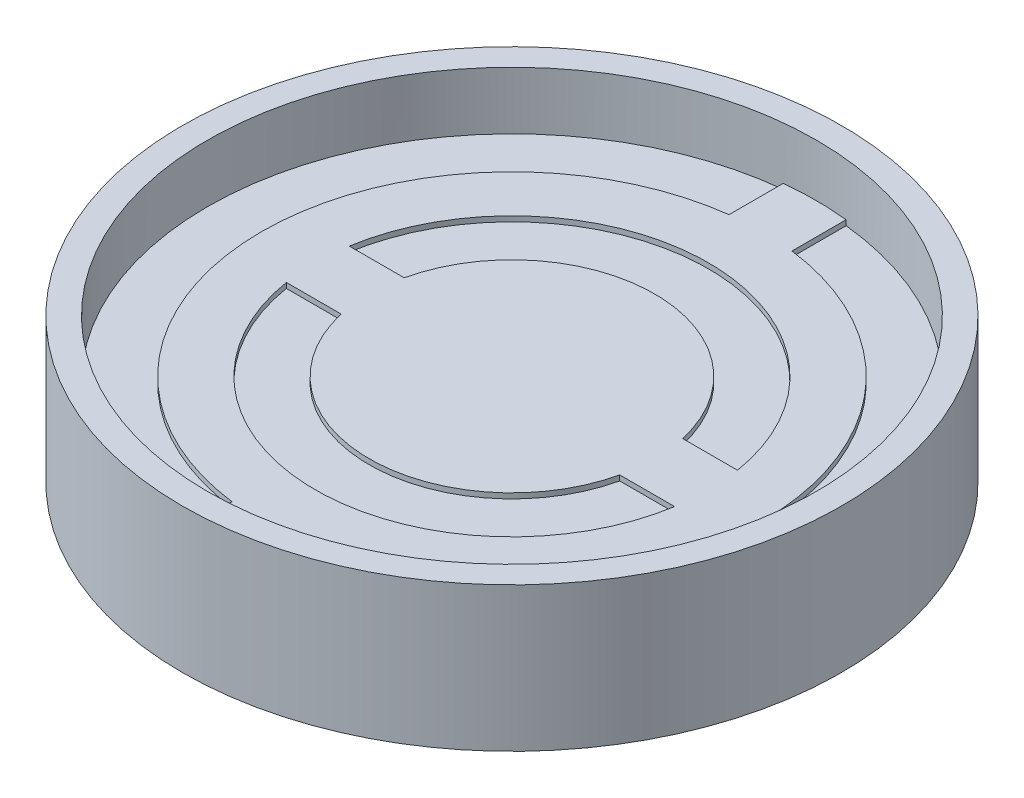
ISO-10303-21;
HEADER;
FILE_DESCRIPTION(('STEP AP214'),'2;1');
FILE_NAME('part.step','',(''),(''),'','','');
FILE_SCHEMA(('AUTOMOTIVE_DESIGN { 1 0 10303 214 1 1 1 1 }'));
ENDSEC;
DATA;
#1=APPLICATION_CONTEXT('core data for automotive mechanical design processes');
#2=APPLICATION_PROTOCOL_DEFINITION('international standard','automotive_design',2000,#1);
#3=PRODUCT_CONTEXT('',#1,'mechanical');
#4=PRODUCT('Part','Part','',(#3));
#5=PRODUCT_RELATED_PRODUCT_CATEGORY('part','',(#4));
#6=PRODUCT_DEFINITION_FORMATION('','',#4);
#7=PRODUCT_DEFINITION_CONTEXT('part definition',#1,'design');
#8=PRODUCT_DEFINITION('design','',#6,#7);
#9=PRODUCT_DEFINITION_SHAPE('','',#8);
#10=(LENGTH_UNIT() NAMED_UNIT(*) SI_UNIT(.MILLI.,.METRE.));
#11=(NAMED_UNIT(*) PLANE_ANGLE_UNIT() SI_UNIT($,.RADIAN.));
#12=(NAMED_UNIT(*) SI_UNIT($,.STERADIAN.) SOLID_ANGLE_UNIT());
#13=UNCERTAINTY_MEASURE_WITH_UNIT(LENGTH_MEASURE(1.E-05),#10,'distance_accuracy_value','');
#14=(GEOMETRIC_REPRESENTATION_CONTEXT(3) GLOBAL_UNCERTAINTY_ASSIGNED_CONTEXT((#13)) GLOBAL_UNIT_ASSIGNED_CONTEXT((#10,
#11,#12)) REPRESENTATION_CONTEXT('',''));
#15=CARTESIAN_POINT('',(0.,0.,0.));
#16=DIRECTION('',(0.,0.,1.));
#17=DIRECTION('',(1.,0.,0.));
#18=AXIS2_PLACEMENT_3D('',#15,#16,#17);
#19=CARTESIAN_POINT('',(0.,-0.6985,0.));
#20=DIRECTION('',(0.,-1.,0.));
#21=DIRECTION('',(0.,0.,1.));
#22=AXIS2_PLACEMENT_3D('',#19,#20,#21);
#23=PLANE('',#22);
#24=CARTESIAN_POINT('',(0.,-0.6985,0.));
#25=DIRECTION('',(0.,1.,0.));
#26=DIRECTION('',(0.,0.,1.));
#27=AXIS2_PLACEMENT_3D('',#24,#25,#26);
#28=CIRCLE('',#27,12.13485);
#29=CARTESIAN_POINT('',(1.524,-0.6985,12.0387710553237));
#30=VERTEX_POINT('',#29);
#31=CARTESIAN_POINT('',(1.524,-0.6985,-12.0387710553237));
#32=VERTEX_POINT('',#31);
#33=EDGE_CURVE('E357',#30,#32,#28,.T.);
#34=ORIENTED_EDGE('',*,*,#33,.T.);
#35=DIRECTION('',(0.,0.,1.));
#36=VECTOR('',#35,1.);
#37=CARTESIAN_POINT('',(1.524,-0.6985,0.));
#38=LINE('',#37,#36);
#39=CARTESIAN_POINT('',(1.524,-0.6985,-14.6657288291445));
#40=VERTEX_POINT('',#39);
#41=EDGE_CURVE('E353',#40,#32,#38,.T.);
#42=ORIENTED_EDGE('',*,*,#41,.F.);
#43=CARTESIAN_POINT('',(0.,-0.6985,0.));
#44=DIRECTION('',(0.,1.,0.));
#45=DIRECTION('',(0.,0.,1.));
#46=AXIS2_PLACEMENT_3D('',#43,#44,#45);
#47=CIRCLE('',#46,14.7447);
#48=CARTESIAN_POINT('',(1.524,-0.6985,14.6657288291445));
#49=VERTEX_POINT('',#48);
#50=EDGE_CURVE('E419',#49,#40,#47,.T.);
#51=ORIENTED_EDGE('',*,*,#50,.F.);
#52=DIRECTION('',(0.,0.,-1.));
#53=VECTOR('',#52,1.);
#54=CARTESIAN_POINT('',(1.524,-0.6985,0.));
#55=LINE('',#54,#53);
#56=EDGE_CURVE('E360',#49,#30,#55,.T.);
#57=ORIENTED_EDGE('',*,*,#56,.T.);
#58=EDGE_LOOP('',(#34,#42,#51,#57));
#59=FACE_BOUND('',#58,.T.);
#60=ADVANCED_FACE('F44',(#59),#23,.T.);
#61=CARTESIAN_POINT('',(0.,0.6985,0.));
#62=DIRECTION('',(0.,1.,0.));
#63=DIRECTION('',(0.,0.,1.));
#64=AXIS2_PLACEMENT_3D('',#61,#62,#63);
#65=CYLINDRICAL_SURFACE('',#64,14.7447);
#66=CARTESIAN_POINT('',(0.,3.4925,0.));
#67=DIRECTION('',(0.,1.,0.));
#68=DIRECTION('',(0.,0.,1.));
#69=AXIS2_PLACEMENT_3D('',#66,#67,#68);
#70=CIRCLE('',#69,14.7447);
#71=CARTESIAN_POINT('',(0.,3.4925,14.7447));
#72=VERTEX_POINT('',#71);
#73=EDGE_CURVE('E559',#72,#72,#70,.T.);
#74=ORIENTED_EDGE('',*,*,#73,.T.);
#75=EDGE_LOOP('',(#74));
#76=FACE_BOUND('',#75,.T.);
#77=DIRECTION('',(0.,-1.,0.));
#78=VECTOR('',#77,1.);
#79=CARTESIAN_POINT('',(-1.524,0.9525,-14.6657288291445));
#80=LINE('',#79,#78);
#81=CARTESIAN_POINT('',(-1.524,0.9525,-14.6657288291445));
#82=VERTEX_POINT('',#81);
#83=CARTESIAN_POINT('',(-1.524,0.6985,-14.6657288291445));
#84=VERTEX_POINT('',#83);
#85=EDGE_CURVE('E527',#82,#84,#80,.T.);
#86=ORIENTED_EDGE('',*,*,#85,.F.);
#87=CARTESIAN_POINT('',(0.,0.9525,0.));
#88=DIRECTION('',(0.,1.,0.));
#89=DIRECTION('',(0.,0.,1.));
#90=AXIS2_PLACEMENT_3D('',#87,#88,#89);
#91=CIRCLE('',#90,14.7447);
#92=CARTESIAN_POINT('',(1.524,0.9525,-14.6657288291445));
#93=VERTEX_POINT('',#92);
#94=EDGE_CURVE('E479',#93,#82,#91,.T.);
#95=ORIENTED_EDGE('',*,*,#94,.F.);
#96=DIRECTION('',(0.,-1.,0.));
#97=VECTOR('',#96,1.);
#98=CARTESIAN_POINT('',(1.524,0.9525,-14.6657288291445));
#99=LINE('',#98,#97);
#100=CARTESIAN_POINT('',(1.524,0.6985,-14.6657288291445));
#101=VERTEX_POINT('',#100);
#102=EDGE_CURVE('E531',#93,#101,#99,.T.);
#103=ORIENTED_EDGE('',*,*,#102,.T.);
#104=CARTESIAN_POINT('',(0.,0.6985,0.));
#105=DIRECTION('',(0.,1.,0.));
#106=DIRECTION('',(0.,0.,1.));
#107=AXIS2_PLACEMENT_3D('',#104,#105,#106);
#108=CIRCLE('',#107,14.7447);
#109=CARTESIAN_POINT('',(1.524,0.6985,14.6657288291445));
#110=VERTEX_POINT('',#109);
#111=EDGE_CURVE('E588',#110,#101,#108,.T.);
#112=ORIENTED_EDGE('',*,*,#111,.F.);
#113=DIRECTION('',(0.,-1.,0.));
#114=VECTOR('',#113,1.);
#115=CARTESIAN_POINT('',(1.524,0.9525,14.6657288291445));
#116=LINE('',#115,#114);
#117=CARTESIAN_POINT('',(1.524,0.9525,14.6657288291445));
#118=VERTEX_POINT('',#117);
#119=EDGE_CURVE('E544',#118,#110,#116,.T.);
#120=ORIENTED_EDGE('',*,*,#119,.F.);
#121=CARTESIAN_POINT('',(0.,0.9525,0.));
#122=DIRECTION('',(0.,1.,0.));
#123=DIRECTION('',(0.,0.,1.));
#124=AXIS2_PLACEMENT_3D('',#121,#122,#123);
#125=CIRCLE('',#124,14.7447);
#126=CARTESIAN_POINT('',(-1.524,0.9525,14.6657288291445));
#127=VERTEX_POINT('',#126);
#128=EDGE_CURVE('E468',#127,#118,#125,.T.);
#129=ORIENTED_EDGE('',*,*,#128,.F.);
#130=DIRECTION('',(0.,-1.,0.));
#131=VECTOR('',#130,1.);
#132=CARTESIAN_POINT('',(-1.524,0.9525,14.6657288291445));
#133=LINE('',#132,#131);
#134=CARTESIAN_POINT('',(-1.524,0.6985,14.6657288291445));
#135=VERTEX_POINT('',#134);
#136=EDGE_CURVE('E548',#127,#135,#133,.T.);
#137=ORIENTED_EDGE('',*,*,#136,.T.);
#138=EDGE_CURVE('E591',#84,#135,#108,.T.);
#139=ORIENTED_EDGE('',*,*,#138,.F.);
#140=EDGE_LOOP('',(#86,#95,#103,#112,#120,#129,#137,#139));
#141=FACE_BOUND('',#140,.T.);
#142=ADVANCED_FACE('F614',(#76,#141),#65,.F.);
#143=CARTESIAN_POINT('',(0.,0.6985,0.));
#144=DIRECTION('',(0.,1.,0.));
#145=DIRECTION('',(0.,0.,1.));
#146=AXIS2_PLACEMENT_3D('',#143,#144,#145);
#147=PLANE('',#146);
#148=CARTESIAN_POINT('',(0.,0.6985,0.));
#149=DIRECTION('',(0.,1.,0.));
#150=DIRECTION('',(0.,0.,1.));
#151=AXIS2_PLACEMENT_3D('',#148,#149,#150);
#152=CIRCLE('',#151,12.13485);
#153=CARTESIAN_POINT('',(-1.524,0.6985,-12.0387710553237));
#154=VERTEX_POINT('',#153);
#155=CARTESIAN_POINT('',(-1.524,0.6985,12.0387710553237));
#156=VERTEX_POINT('',#155);
#157=EDGE_CURVE('E513',#154,#156,#152,.T.);
#158=ORIENTED_EDGE('',*,*,#157,.F.);
#159=DIRECTION('',(0.,0.,1.));
#160=VECTOR('',#159,1.);
#161=CARTESIAN_POINT('',(-1.524,0.6985,0.));
#162=LINE('',#161,#160);
#163=EDGE_CURVE('E509',#84,#154,#162,.T.);
#164=ORIENTED_EDGE('',*,*,#163,.F.);
#165=ORIENTED_EDGE('',*,*,#138,.T.);
#166=DIRECTION('',(0.,0.,-1.));
#167=VECTOR('',#166,1.);
#168=CARTESIAN_POINT('',(-1.524,0.6985,0.));
#169=LINE('',#168,#167);
#170=EDGE_CURVE('E517',#135,#156,#169,.T.);
#171=ORIENTED_EDGE('',*,*,#170,.T.);
#172=EDGE_LOOP('',(#158,#164,#165,#171));
#173=FACE_BOUND('',#172,.T.);
#174=ADVANCED_FACE('F601',(#173),#147,.T.);
#175=CARTESIAN_POINT('',(1.524,0.6985,12.0387710553237));
#176=VERTEX_POINT('',#175);
#177=CARTESIAN_POINT('',(1.524,0.6985,-12.0387710553237));
#178=VERTEX_POINT('',#177);
#179=EDGE_CURVE('E518',#176,#178,#152,.T.);
#180=ORIENTED_EDGE('',*,*,#179,.F.);
#181=DIRECTION('',(0.,0.,-1.));
#182=VECTOR('',#181,1.);
#183=CARTESIAN_POINT('',(1.524,0.6985,0.));
#184=LINE('',#183,#182);
#185=EDGE_CURVE('E521',#110,#176,#184,.T.);
#186=ORIENTED_EDGE('',*,*,#185,.F.);
#187=ORIENTED_EDGE('',*,*,#111,.T.);
#188=DIRECTION('',(0.,0.,1.));
#189=VECTOR('',#188,1.);
#190=CARTESIAN_POINT('',(1.524,0.6985,0.));
#191=LINE('',#190,#189);
#192=EDGE_CURVE('E432',#101,#178,#191,.T.);
#193=ORIENTED_EDGE('',*,*,#192,.T.);
#194=EDGE_LOOP('',(#180,#186,#187,#193));
#195=FACE_BOUND('',#194,.T.);
#196=ADVANCED_FACE('F819',(#195),#147,.T.);
#197=CARTESIAN_POINT('',(0.,3.4925,0.));
#198=DIRECTION('',(0.,-1.,0.));
#199=DIRECTION('',(0.,0.,-1.));
#200=AXIS2_PLACEMENT_3D('',#197,#198,#199);
#201=CYLINDRICAL_SURFACE('',#200,15.9639);
#202=CARTESIAN_POINT('',(0.,3.4925,0.));
#203=DIRECTION('',(0.,1.,0.));
#204=DIRECTION('',(0.,0.,1.));
#205=AXIS2_PLACEMENT_3D('',#202,#203,#204);
#206=CIRCLE('',#205,15.9639);
#207=CARTESIAN_POINT('',(0.,3.4925,15.9639));
#208=VERTEX_POINT('',#207);
#209=EDGE_CURVE('E11',#208,#208,#206,.T.);
#210=ORIENTED_EDGE('',*,*,#209,.F.);
#211=EDGE_LOOP('',(#210));
#212=FACE_BOUND('',#211,.T.);
#213=CARTESIAN_POINT('',(0.,-3.4925,0.));
#214=DIRECTION('',(0.,1.,0.));
#215=DIRECTION('',(0.,0.,1.));
#216=AXIS2_PLACEMENT_3D('',#213,#214,#215);
#217=CIRCLE('',#216,15.9639);
#218=CARTESIAN_POINT('',(0.,-3.4925,15.9639));
#219=VERTEX_POINT('',#218);
#220=EDGE_CURVE('E48',#219,#219,#217,.T.);
#221=ORIENTED_EDGE('',*,*,#220,.T.);
#222=EDGE_LOOP('',(#221));
#223=FACE_BOUND('',#222,.T.);
#224=ADVANCED_FACE('F46',(#212,#223),#201,.T.);
#225=CARTESIAN_POINT('',(0.,3.4925,0.));
#226=DIRECTION('',(0.,1.,0.));
#227=DIRECTION('',(0.,0.,1.));
#228=AXIS2_PLACEMENT_3D('',#225,#226,#227);
#229=PLANE('',#228);
#230=ORIENTED_EDGE('',*,*,#73,.F.);
#231=EDGE_LOOP('',(#230));
#232=FACE_BOUND('',#231,.T.);
#233=ORIENTED_EDGE('',*,*,#209,.T.);
#234=EDGE_LOOP('',(#233));
#235=FACE_BOUND('',#234,.T.);
#236=ADVANCED_FACE('F799',(#232,#235),#229,.T.);
#237=CARTESIAN_POINT('',(0.,-3.4925,0.));
#238=DIRECTION('',(0.,1.,0.));
#239=DIRECTION('',(0.,0.,1.));
#240=AXIS2_PLACEMENT_3D('',#237,#238,#239);
#241=PLANE('',#240);
#242=CARTESIAN_POINT('',(0.,-3.4925,0.));
#243=DIRECTION('',(0.,1.,0.));
#244=DIRECTION('',(0.,0.,1.));
#245=AXIS2_PLACEMENT_3D('',#242,#243,#244);
#246=CIRCLE('',#245,14.7447);
#247=CARTESIAN_POINT('',(0.,-3.4925,14.7447));
#248=VERTEX_POINT('',#247);
#249=EDGE_CURVE('E396',#248,#248,#246,.T.);
#250=ORIENTED_EDGE('',*,*,#249,.T.);
#251=EDGE_LOOP('',(#250));
#252=FACE_BOUND('',#251,.T.);
#253=ORIENTED_EDGE('',*,*,#220,.F.);
#254=EDGE_LOOP('',(#253));
#255=FACE_BOUND('',#254,.T.);
#256=ADVANCED_FACE('F795',(#252,#255),#241,.F.);
#257=CARTESIAN_POINT('',(-1.524,0.9525,0.));
#258=DIRECTION('',(1.,0.,0.));
#259=DIRECTION('',(0.,0.,-1.));
#260=AXIS2_PLACEMENT_3D('',#257,#258,#259);
#261=PLANE('',#260);
#262=ORIENTED_EDGE('',*,*,#163,.T.);
#263=DIRECTION('',(0.,-1.,0.));
#264=VECTOR('',#263,1.);
#265=CARTESIAN_POINT('',(-1.524,0.9525,-12.0387710553237));
#266=LINE('',#265,#264);
#267=CARTESIAN_POINT('',(-1.524,0.9525,-12.0387710553237));
#268=VERTEX_POINT('',#267);
#269=EDGE_CURVE('E555',#268,#154,#266,.T.);
#270=ORIENTED_EDGE('',*,*,#269,.F.);
#271=DIRECTION('',(0.,0.,1.));
#272=VECTOR('',#271,1.);
#273=CARTESIAN_POINT('',(-1.524,0.9525,0.));
#274=LINE('',#273,#272);
#275=EDGE_CURVE('E456',#82,#268,#274,.T.);
#276=ORIENTED_EDGE('',*,*,#275,.F.);
#277=ORIENTED_EDGE('',*,*,#85,.T.);
#278=EDGE_LOOP('',(#262,#270,#276,#277));
#279=FACE_BOUND('',#278,.T.);
#280=ADVANCED_FACE('F613',(#279),#261,.F.);
#281=CARTESIAN_POINT('',(0.,0.9525,0.));
#282=DIRECTION('',(0.,-1.,0.));
#283=DIRECTION('',(0.,0.,-1.));
#284=AXIS2_PLACEMENT_3D('',#281,#282,#283);
#285=CYLINDRICAL_SURFACE('',#284,12.13485);
#286=ORIENTED_EDGE('',*,*,#157,.T.);
#287=DIRECTION('',(0.,-1.,0.));
#288=VECTOR('',#287,1.);
#289=CARTESIAN_POINT('',(-1.524,0.9525,12.0387710553237));
#290=LINE('',#289,#288);
#291=CARTESIAN_POINT('',(-1.524,0.9525,12.0387710553237));
#292=VERTEX_POINT('',#291);
#293=EDGE_CURVE('E551',#292,#156,#290,.T.);
#294=ORIENTED_EDGE('',*,*,#293,.F.);
#295=CARTESIAN_POINT('',(0.,0.9525,0.));
#296=DIRECTION('',(0.,1.,0.));
#297=DIRECTION('',(0.,0.,1.));
#298=AXIS2_PLACEMENT_3D('',#295,#296,#297);
#299=CIRCLE('',#298,12.13485);
#300=EDGE_CURVE('E460',#268,#292,#299,.T.);
#301=ORIENTED_EDGE('',*,*,#300,.F.);
#302=ORIENTED_EDGE('',*,*,#269,.T.);
#303=EDGE_LOOP('',(#286,#294,#301,#302));
#304=FACE_BOUND('',#303,.T.);
#305=ADVANCED_FACE('F609',(#304),#285,.T.);
#306=CARTESIAN_POINT('',(-1.524,0.9525,0.));
#307=DIRECTION('',(-1.,0.,0.));
#308=DIRECTION('',(0.,0.,1.));
#309=AXIS2_PLACEMENT_3D('',#306,#307,#308);
#310=PLANE('',#309);
#311=ORIENTED_EDGE('',*,*,#170,.F.);
#312=ORIENTED_EDGE('',*,*,#136,.F.);
#313=DIRECTION('',(0.,0.,-1.));
#314=VECTOR('',#313,1.);
#315=CARTESIAN_POINT('',(-1.524,0.9525,0.));
#316=LINE('',#315,#314);
#317=EDGE_CURVE('E463',#127,#292,#316,.T.);
#318=ORIENTED_EDGE('',*,*,#317,.T.);
#319=ORIENTED_EDGE('',*,*,#293,.T.);
#320=EDGE_LOOP('',(#311,#312,#318,#319));
#321=FACE_BOUND('',#320,.T.);
#322=ADVANCED_FACE('F605',(#321),#310,.T.);
#323=CARTESIAN_POINT('',(1.524,0.9525,0.));
#324=DIRECTION('',(-1.,0.,0.));
#325=DIRECTION('',(0.,0.,1.));
#326=AXIS2_PLACEMENT_3D('',#323,#324,#325);
#327=PLANE('',#326);
#328=ORIENTED_EDGE('',*,*,#185,.T.);
#329=DIRECTION('',(0.,-1.,0.));
#330=VECTOR('',#329,1.);
#331=CARTESIAN_POINT('',(1.524,0.9525,12.0387710553237));
#332=LINE('',#331,#330);
#333=CARTESIAN_POINT('',(1.524,0.9525,12.0387710553237));
#334=VERTEX_POINT('',#333);
#335=EDGE_CURVE('E540',#334,#176,#332,.T.);
#336=ORIENTED_EDGE('',*,*,#335,.F.);
#337=DIRECTION('',(0.,0.,-1.));
#338=VECTOR('',#337,1.);
#339=CARTESIAN_POINT('',(1.524,0.9525,0.));
#340=LINE('',#339,#338);
#341=EDGE_CURVE('E472',#118,#334,#340,.T.);
#342=ORIENTED_EDGE('',*,*,#341,.F.);
#343=ORIENTED_EDGE('',*,*,#119,.T.);
#344=EDGE_LOOP('',(#328,#336,#342,#343));
#345=FACE_BOUND('',#344,.T.);
#346=ADVANCED_FACE('F629',(#345),#327,.F.);
#347=ORIENTED_EDGE('',*,*,#179,.T.);
#348=DIRECTION('',(0.,-1.,0.));
#349=VECTOR('',#348,1.);
#350=CARTESIAN_POINT('',(1.524,0.9525,-12.0387710553237));
#351=LINE('',#350,#349);
#352=CARTESIAN_POINT('',(1.524,0.9525,-12.0387710553237));
#353=VERTEX_POINT('',#352);
#354=EDGE_CURVE('E536',#353,#178,#351,.T.);
#355=ORIENTED_EDGE('',*,*,#354,.F.);
#356=EDGE_CURVE('E464',#334,#353,#299,.T.);
#357=ORIENTED_EDGE('',*,*,#356,.F.);
#358=ORIENTED_EDGE('',*,*,#335,.T.);
#359=EDGE_LOOP('',(#347,#355,#357,#358));
#360=FACE_BOUND('',#359,.T.);
#361=ADVANCED_FACE('F632',(#360),#285,.T.);
#362=CARTESIAN_POINT('',(1.524,0.9525,0.));
#363=DIRECTION('',(1.,0.,0.));
#364=DIRECTION('',(0.,0.,-1.));
#365=AXIS2_PLACEMENT_3D('',#362,#363,#364);
#366=PLANE('',#365);
#367=ORIENTED_EDGE('',*,*,#192,.F.);
#368=ORIENTED_EDGE('',*,*,#102,.F.);
#369=DIRECTION('',(0.,0.,1.));
#370=VECTOR('',#369,1.);
#371=CARTESIAN_POINT('',(1.524,0.9525,0.));
#372=LINE('',#371,#370);
#373=EDGE_CURVE('E475',#93,#353,#372,.T.);
#374=ORIENTED_EDGE('',*,*,#373,.T.);
#375=ORIENTED_EDGE('',*,*,#354,.T.);
#376=EDGE_LOOP('',(#367,#368,#374,#375));
#377=FACE_BOUND('',#376,.T.);
#378=ADVANCED_FACE('F623',(#377),#366,.T.);
#379=CARTESIAN_POINT('',(0.,0.9525,0.));
#380=DIRECTION('',(0.,-1.,0.));
#381=DIRECTION('',(0.,0.,-1.));
#382=AXIS2_PLACEMENT_3D('',#379,#380,#381);
#383=CYLINDRICAL_SURFACE('',#382,9.525);
#384=CARTESIAN_POINT('',(0.,0.6985,0.));
#385=DIRECTION('',(0.,1.,0.));
#386=DIRECTION('',(0.,0.,1.));
#387=AXIS2_PLACEMENT_3D('',#384,#385,#386);
#388=CIRCLE('',#387,9.525);
#389=CARTESIAN_POINT('',(9.40228956159084,0.6985,-1.524));
#390=VERTEX_POINT('',#389);
#391=CARTESIAN_POINT('',(-9.40228956159084,0.6985,-1.524));
#392=VERTEX_POINT('',#391);
#393=EDGE_CURVE('E499',#390,#392,#388,.T.);
#394=ORIENTED_EDGE('',*,*,#393,.F.);
#395=DIRECTION('',(0.,-1.,0.));
#396=VECTOR('',#395,1.);
#397=CARTESIAN_POINT('',(9.40228956159084,0.9525,-1.524));
#398=LINE('',#397,#396);
#399=CARTESIAN_POINT('',(9.40228956159084,0.9525,-1.524));
#400=VERTEX_POINT('',#399);
#401=EDGE_CURVE('E532',#400,#390,#398,.T.);
#402=ORIENTED_EDGE('',*,*,#401,.F.);
#403=CARTESIAN_POINT('',(0.,0.9525,0.));
#404=DIRECTION('',(0.,1.,0.));
#405=DIRECTION('',(0.,0.,1.));
#406=AXIS2_PLACEMENT_3D('',#403,#404,#405);
#407=CIRCLE('',#406,9.525);
#408=CARTESIAN_POINT('',(-9.40228956159084,0.9525,-1.524));
#409=VERTEX_POINT('',#408);
#410=EDGE_CURVE('E444',#400,#409,#407,.T.);
#411=ORIENTED_EDGE('',*,*,#410,.T.);
#412=DIRECTION('',(0.,-1.,0.));
#413=VECTOR('',#412,1.);
#414=CARTESIAN_POINT('',(-9.40228956159084,0.9525,-1.524));
#415=LINE('',#414,#413);
#416=EDGE_CURVE('E560',#409,#392,#415,.T.);
#417=ORIENTED_EDGE('',*,*,#416,.T.);
#418=EDGE_LOOP('',(#394,#402,#411,#417));
#419=FACE_BOUND('',#418,.T.);
#420=ADVANCED_FACE('F905',(#419),#383,.F.);
#421=CARTESIAN_POINT('',(0.,0.9525,-1.524));
#422=DIRECTION('',(0.,0.,1.));
#423=DIRECTION('',(1.,0.,0.));
#424=AXIS2_PLACEMENT_3D('',#421,#422,#423);
#425=PLANE('',#424);
#426=DIRECTION('',(-1.,0.,0.));
#427=VECTOR('',#426,1.);
#428=CARTESIAN_POINT('',(0.,0.6985,-1.524));
#429=LINE('',#428,#427);
#430=CARTESIAN_POINT('',(6.7451259085728,0.6985,-1.524));
#431=VERTEX_POINT('',#430);
#432=EDGE_CURVE('E502',#390,#431,#429,.T.);
#433=ORIENTED_EDGE('',*,*,#432,.T.);
#434=DIRECTION('',(0.,-1.,0.));
#435=VECTOR('',#434,1.);
#436=CARTESIAN_POINT('',(6.7451259085728,0.9525,-1.524));
#437=LINE('',#436,#435);
#438=CARTESIAN_POINT('',(6.7451259085728,0.9525,-1.524));
#439=VERTEX_POINT('',#438);
#440=EDGE_CURVE('E569',#439,#431,#437,.T.);
#441=ORIENTED_EDGE('',*,*,#440,.F.);
#442=DIRECTION('',(-1.,0.,0.));
#443=VECTOR('',#442,1.);
#444=CARTESIAN_POINT('',(0.,0.9525,-1.524));
#445=LINE('',#444,#443);
#446=EDGE_CURVE('E448',#400,#439,#445,.T.);
#447=ORIENTED_EDGE('',*,*,#446,.F.);
#448=ORIENTED_EDGE('',*,*,#401,.T.);
#449=EDGE_LOOP('',(#433,#441,#447,#448));
#450=FACE_BOUND('',#449,.T.);
#451=ADVANCED_FACE('F896',(#450),#425,.F.);
#452=CARTESIAN_POINT('',(0.,0.9525,0.));
#453=DIRECTION('',(0.,-1.,0.));
#454=DIRECTION('',(0.,0.,-1.));
#455=AXIS2_PLACEMENT_3D('',#452,#453,#454);
#456=CYLINDRICAL_SURFACE('',#455,6.91515);
#457=CARTESIAN_POINT('',(0.,0.6985,0.));
#458=DIRECTION('',(0.,1.,0.));
#459=DIRECTION('',(0.,0.,1.));
#460=AXIS2_PLACEMENT_3D('',#457,#458,#459);
#461=CIRCLE('',#460,6.91515);
#462=CARTESIAN_POINT('',(-6.7451259085728,0.6985,-1.524));
#463=VERTEX_POINT('',#462);
#464=EDGE_CURVE('E488',#431,#463,#461,.T.);
#465=ORIENTED_EDGE('',*,*,#464,.T.);
#466=DIRECTION('',(0.,-1.,0.));
#467=VECTOR('',#466,1.);
#468=CARTESIAN_POINT('',(-6.7451259085728,0.9525,-1.524));
#469=LINE('',#468,#467);
#470=CARTESIAN_POINT('',(-6.7451259085728,0.9525,-1.524));
#471=VERTEX_POINT('',#470);
#472=EDGE_CURVE('E564',#471,#463,#469,.T.);
#473=ORIENTED_EDGE('',*,*,#472,.F.);
#474=CARTESIAN_POINT('',(0.,0.9525,0.));
#475=DIRECTION('',(0.,1.,0.));
#476=DIRECTION('',(0.,0.,1.));
#477=AXIS2_PLACEMENT_3D('',#474,#475,#476);
#478=CIRCLE('',#477,6.91515);
#479=EDGE_CURVE('E433',#439,#471,#478,.T.);
#480=ORIENTED_EDGE('',*,*,#479,.F.);
#481=ORIENTED_EDGE('',*,*,#440,.T.);
#482=EDGE_LOOP('',(#465,#473,#480,#481));
#483=FACE_BOUND('',#482,.T.);
#484=ADVANCED_FACE('F886',(#483),#456,.T.);
#485=CARTESIAN_POINT('',(-6.7451259085728,0.6985,1.524));
#486=VERTEX_POINT('',#485);
#487=CARTESIAN_POINT('',(6.7451259085728,0.6985,1.524));
#488=VERTEX_POINT('',#487);
#489=EDGE_CURVE('E423',#486,#488,#461,.T.);
#490=ORIENTED_EDGE('',*,*,#489,.T.);
#491=DIRECTION('',(0.,-1.,0.));
#492=VECTOR('',#491,1.);
#493=CARTESIAN_POINT('',(6.7451259085728,0.9525,1.524));
#494=LINE('',#493,#492);
#495=CARTESIAN_POINT('',(6.7451259085728,0.9525,1.524));
#496=VERTEX_POINT('',#495);
#497=EDGE_CURVE('E565',#496,#488,#494,.T.);
#498=ORIENTED_EDGE('',*,*,#497,.F.);
#499=CARTESIAN_POINT('',(-6.7451259085728,0.9525,1.524));
#500=VERTEX_POINT('',#499);
#501=EDGE_CURVE('E428',#500,#496,#478,.T.);
#502=ORIENTED_EDGE('',*,*,#501,.F.);
#503=DIRECTION('',(0.,-1.,0.));
#504=VECTOR('',#503,1.);
#505=CARTESIAN_POINT('',(-6.7451259085728,0.9525,1.524));
#506=LINE('',#505,#504);
#507=EDGE_CURVE('E483',#500,#486,#506,.T.);
#508=ORIENTED_EDGE('',*,*,#507,.T.);
#509=EDGE_LOOP('',(#490,#498,#502,#508));
#510=FACE_BOUND('',#509,.T.);
#511=ADVANCED_FACE('F876',(#510),#456,.T.);
#512=CARTESIAN_POINT('',(0.,0.9525,1.524));
#513=DIRECTION('',(0.,0.,1.));
#514=DIRECTION('',(1.,0.,0.));
#515=AXIS2_PLACEMENT_3D('',#512,#513,#514);
#516=PLANE('',#515);
#517=DIRECTION('',(-1.,0.,0.));
#518=VECTOR('',#517,1.);
#519=CARTESIAN_POINT('',(0.,0.6985,1.524));
#520=LINE('',#519,#518);
#521=CARTESIAN_POINT('',(9.40228956159084,0.6985,1.524));
#522=VERTEX_POINT('',#521);
#523=EDGE_CURVE('E487',#522,#488,#520,.T.);
#524=ORIENTED_EDGE('',*,*,#523,.F.);
#525=DIRECTION('',(0.,-1.,0.));
#526=VECTOR('',#525,1.);
#527=CARTESIAN_POINT('',(9.40228956159084,0.9525,1.524));
#528=LINE('',#527,#526);
#529=CARTESIAN_POINT('',(9.40228956159084,0.9525,1.524));
#530=VERTEX_POINT('',#529);
#531=EDGE_CURVE('E583',#530,#522,#528,.T.);
#532=ORIENTED_EDGE('',*,*,#531,.F.);
#533=DIRECTION('',(-1.,0.,0.));
#534=VECTOR('',#533,1.);
#535=CARTESIAN_POINT('',(0.,0.9525,1.524));
#536=LINE('',#535,#534);
#537=EDGE_CURVE('E431',#530,#496,#536,.T.);
#538=ORIENTED_EDGE('',*,*,#537,.T.);
#539=ORIENTED_EDGE('',*,*,#497,.T.);
#540=EDGE_LOOP('',(#524,#532,#538,#539));
#541=FACE_BOUND('',#540,.T.);
#542=ADVANCED_FACE('F866',(#541),#516,.T.);
#543=CARTESIAN_POINT('',(0.,0.9525,0.));
#544=DIRECTION('',(0.,-1.,0.));
#545=DIRECTION('',(0.,0.,-1.));
#546=AXIS2_PLACEMENT_3D('',#543,#544,#545);
#547=CYLINDRICAL_SURFACE('',#546,9.525);
#548=CARTESIAN_POINT('',(0.,0.6985,0.));
#549=DIRECTION('',(0.,1.,0.));
#550=DIRECTION('',(0.,0.,1.));
#551=AXIS2_PLACEMENT_3D('',#548,#549,#550);
#552=CIRCLE('',#551,9.525);
#553=CARTESIAN_POINT('',(-9.40228956159084,0.6985,1.524));
#554=VERTEX_POINT('',#553);
#555=EDGE_CURVE('E492',#554,#522,#552,.T.);
#556=ORIENTED_EDGE('',*,*,#555,.F.);
#557=DIRECTION('',(0.,-1.,0.));
#558=VECTOR('',#557,1.);
#559=CARTESIAN_POINT('',(-9.40228956159084,0.9525,1.524));
#560=LINE('',#559,#558);
#561=CARTESIAN_POINT('',(-9.40228956159084,0.9525,1.524));
#562=VERTEX_POINT('',#561);
#563=EDGE_CURVE('E579',#562,#554,#560,.T.);
#564=ORIENTED_EDGE('',*,*,#563,.F.);
#565=CARTESIAN_POINT('',(0.,0.9525,0.));
#566=DIRECTION('',(0.,1.,0.));
#567=DIRECTION('',(0.,0.,1.));
#568=AXIS2_PLACEMENT_3D('',#565,#566,#567);
#569=CIRCLE('',#568,9.525);
#570=EDGE_CURVE('E437',#562,#530,#569,.T.);
#571=ORIENTED_EDGE('',*,*,#570,.T.);
#572=ORIENTED_EDGE('',*,*,#531,.T.);
#573=EDGE_LOOP('',(#556,#564,#571,#572));
#574=FACE_BOUND('',#573,.T.);
#575=ADVANCED_FACE('F856',(#574),#547,.F.);
#576=CARTESIAN_POINT('',(0.,0.9525,-1.524));
#577=DIRECTION('',(0.,0.,-1.));
#578=DIRECTION('',(-1.,0.,0.));
#579=AXIS2_PLACEMENT_3D('',#576,#577,#578);
#580=PLANE('',#579);
#581=DIRECTION('',(1.,0.,0.));
#582=VECTOR('',#581,1.);
#583=CARTESIAN_POINT('',(0.,0.6985,-1.524));
#584=LINE('',#583,#582);
#585=EDGE_CURVE('E506',#392,#463,#584,.T.);
#586=ORIENTED_EDGE('',*,*,#585,.F.);
#587=ORIENTED_EDGE('',*,*,#416,.F.);
#588=DIRECTION('',(1.,0.,0.));
#589=VECTOR('',#588,1.);
#590=CARTESIAN_POINT('',(0.,0.9525,-1.524));
#591=LINE('',#590,#589);
#592=EDGE_CURVE('E452',#409,#471,#591,.T.);
#593=ORIENTED_EDGE('',*,*,#592,.T.);
#594=ORIENTED_EDGE('',*,*,#472,.T.);
#595=EDGE_LOOP('',(#586,#587,#593,#594));
#596=FACE_BOUND('',#595,.T.);
#597=ADVANCED_FACE('F845',(#596),#580,.T.);
#598=CARTESIAN_POINT('',(0.,0.9525,1.524));
#599=DIRECTION('',(0.,0.,-1.));
#600=DIRECTION('',(-1.,0.,0.));
#601=AXIS2_PLACEMENT_3D('',#598,#599,#600);
#602=PLANE('',#601);
#603=DIRECTION('',(1.,0.,0.));
#604=VECTOR('',#603,1.);
#605=CARTESIAN_POINT('',(0.,0.6985,1.524));
#606=LINE('',#605,#604);
#607=EDGE_CURVE('E496',#554,#486,#606,.T.);
#608=ORIENTED_EDGE('',*,*,#607,.T.);
#609=ORIENTED_EDGE('',*,*,#507,.F.);
#610=DIRECTION('',(1.,0.,0.));
#611=VECTOR('',#610,1.);
#612=CARTESIAN_POINT('',(0.,0.9525,1.524));
#613=LINE('',#612,#611);
#614=EDGE_CURVE('E441',#562,#500,#613,.T.);
#615=ORIENTED_EDGE('',*,*,#614,.F.);
#616=ORIENTED_EDGE('',*,*,#563,.T.);
#617=EDGE_LOOP('',(#608,#609,#615,#616));
#618=FACE_BOUND('',#617,.T.);
#619=ADVANCED_FACE('F834',(#618),#602,.F.);
#620=CARTESIAN_POINT('',(0.,0.9525,0.));
#621=DIRECTION('',(0.,1.,0.));
#622=DIRECTION('',(0.,0.,1.));
#623=AXIS2_PLACEMENT_3D('',#620,#621,#622);
#624=PLANE('',#623);
#625=ORIENTED_EDGE('',*,*,#501,.T.);
#626=ORIENTED_EDGE('',*,*,#537,.F.);
#627=ORIENTED_EDGE('',*,*,#570,.F.);
#628=ORIENTED_EDGE('',*,*,#614,.T.);
#629=EDGE_LOOP('',(#625,#626,#627,#628));
#630=FACE_BOUND('',#629,.T.);
#631=ORIENTED_EDGE('',*,*,#410,.F.);
#632=ORIENTED_EDGE('',*,*,#446,.T.);
#633=ORIENTED_EDGE('',*,*,#479,.T.);
#634=ORIENTED_EDGE('',*,*,#592,.F.);
#635=EDGE_LOOP('',(#631,#632,#633,#634));
#636=FACE_BOUND('',#635,.T.);
#637=ORIENTED_EDGE('',*,*,#275,.T.);
#638=ORIENTED_EDGE('',*,*,#300,.T.);
#639=ORIENTED_EDGE('',*,*,#317,.F.);
#640=ORIENTED_EDGE('',*,*,#128,.T.);
#641=ORIENTED_EDGE('',*,*,#341,.T.);
#642=ORIENTED_EDGE('',*,*,#356,.T.);
#643=ORIENTED_EDGE('',*,*,#373,.F.);
#644=ORIENTED_EDGE('',*,*,#94,.T.);
#645=EDGE_LOOP('',(#637,#638,#639,#640,#641,#642,#643,#644));
#646=FACE_BOUND('',#645,.T.);
#647=ADVANCED_FACE('F618',(#630,#636,#646),#624,.T.);
#648=ORIENTED_EDGE('',*,*,#393,.T.);
#649=ORIENTED_EDGE('',*,*,#585,.T.);
#650=ORIENTED_EDGE('',*,*,#464,.F.);
#651=ORIENTED_EDGE('',*,*,#432,.F.);
#652=EDGE_LOOP('',(#648,#649,#650,#651));
#653=FACE_BOUND('',#652,.T.);
#654=ADVANCED_FACE('F816',(#653),#147,.T.);
#655=ORIENTED_EDGE('',*,*,#523,.T.);
#656=ORIENTED_EDGE('',*,*,#489,.F.);
#657=ORIENTED_EDGE('',*,*,#607,.F.);
#658=ORIENTED_EDGE('',*,*,#555,.T.);
#659=EDGE_LOOP('',(#655,#656,#657,#658));
#660=FACE_BOUND('',#659,.T.);
#661=ADVANCED_FACE('F789',(#660),#147,.T.);
#662=CARTESIAN_POINT('',(0.,-0.6985,0.));
#663=DIRECTION('',(0.,-1.,0.));
#664=DIRECTION('',(0.,0.,-1.));
#665=AXIS2_PLACEMENT_3D('',#662,#663,#664);
#666=CYLINDRICAL_SURFACE('',#665,14.7447);
#667=DIRECTION('',(0.,1.,0.));
#668=VECTOR('',#667,1.);
#669=CARTESIAN_POINT('',(1.524,-0.9525,14.6657288291445));
#670=LINE('',#669,#668);
#671=CARTESIAN_POINT('',(1.524,-0.9525,14.6657288291445));
#672=VERTEX_POINT('',#671);
#673=EDGE_CURVE('E378',#672,#49,#670,.T.);
#674=ORIENTED_EDGE('',*,*,#673,.T.);
#675=ORIENTED_EDGE('',*,*,#50,.T.);
#676=DIRECTION('',(0.,1.,0.));
#677=VECTOR('',#676,1.);
#678=CARTESIAN_POINT('',(1.524,-0.9525,-14.6657288291445));
#679=LINE('',#678,#677);
#680=CARTESIAN_POINT('',(1.524,-0.9525,-14.6657288291445));
#681=VERTEX_POINT('',#680);
#682=EDGE_CURVE('E389',#681,#40,#679,.T.);
#683=ORIENTED_EDGE('',*,*,#682,.F.);
#684=CARTESIAN_POINT('',(0.,-0.9525,0.));
#685=DIRECTION('',(0.,1.,0.));
#686=DIRECTION('',(0.,0.,1.));
#687=AXIS2_PLACEMENT_3D('',#684,#685,#686);
#688=CIRCLE('',#687,14.7447);
#689=CARTESIAN_POINT('',(-1.524,-0.9525,-14.6657288291445));
#690=VERTEX_POINT('',#689);
#691=EDGE_CURVE('E305',#681,#690,#688,.T.);
#692=ORIENTED_EDGE('',*,*,#691,.T.);
#693=DIRECTION('',(0.,1.,0.));
#694=VECTOR('',#693,1.);
#695=CARTESIAN_POINT('',(-1.524,-0.9525,-14.6657288291445));
#696=LINE('',#695,#694);
#697=CARTESIAN_POINT('',(-1.524,-0.6985,-14.6657288291445));
#698=VERTEX_POINT('',#697);
#699=EDGE_CURVE('E393',#690,#698,#696,.T.);
#700=ORIENTED_EDGE('',*,*,#699,.T.);
#701=CARTESIAN_POINT('',(-1.524,-0.6985,14.6657288291445));
#702=VERTEX_POINT('',#701);
#703=EDGE_CURVE('E424',#698,#702,#47,.T.);
#704=ORIENTED_EDGE('',*,*,#703,.T.);
#705=DIRECTION('',(0.,1.,0.));
#706=VECTOR('',#705,1.);
#707=CARTESIAN_POINT('',(-1.524,-0.9525,14.6657288291445));
#708=LINE('',#707,#706);
#709=CARTESIAN_POINT('',(-1.524,-0.9525,14.6657288291445));
#710=VERTEX_POINT('',#709);
#711=EDGE_CURVE('E60',#710,#702,#708,.T.);
#712=ORIENTED_EDGE('',*,*,#711,.F.);
#713=CARTESIAN_POINT('',(0.,-0.9525,0.));
#714=DIRECTION('',(0.,1.,0.));
#715=DIRECTION('',(0.,0.,1.));
#716=AXIS2_PLACEMENT_3D('',#713,#714,#715);
#717=CIRCLE('',#716,14.7447);
#718=EDGE_CURVE('E65',#710,#672,#717,.T.);
#719=ORIENTED_EDGE('',*,*,#718,.T.);
#720=EDGE_LOOP('',(#674,#675,#683,#692,#700,#704,#712,#719));
#721=FACE_BOUND('',#720,.T.);
#722=ORIENTED_EDGE('',*,*,#249,.F.);
#723=EDGE_LOOP('',(#722));
#724=FACE_BOUND('',#723,.T.);
#725=ADVANCED_FACE('F682',(#721,#724),#666,.F.);
#726=DIRECTION('',(0.,0.,1.));
#727=VECTOR('',#726,1.);
#728=CARTESIAN_POINT('',(-1.524,-0.6985,0.));
#729=LINE('',#728,#727);
#730=CARTESIAN_POINT('',(-1.524,-0.6985,-12.0387710553237));
#731=VERTEX_POINT('',#730);
#732=EDGE_CURVE('E350',#698,#731,#729,.T.);
#733=ORIENTED_EDGE('',*,*,#732,.T.);
#734=CARTESIAN_POINT('',(-1.524,-0.6985,12.0387710553237));
#735=VERTEX_POINT('',#734);
#736=EDGE_CURVE('E277',#731,#735,#28,.T.);
#737=ORIENTED_EDGE('',*,*,#736,.T.);
#738=DIRECTION('',(0.,0.,-1.));
#739=VECTOR('',#738,1.);
#740=CARTESIAN_POINT('',(-1.524,-0.6985,0.));
#741=LINE('',#740,#739);
#742=EDGE_CURVE('E363',#702,#735,#741,.T.);
#743=ORIENTED_EDGE('',*,*,#742,.F.);
#744=ORIENTED_EDGE('',*,*,#703,.F.);
#745=EDGE_LOOP('',(#733,#737,#743,#744));
#746=FACE_BOUND('',#745,.T.);
#747=ADVANCED_FACE('F665',(#746),#23,.T.);
#748=CARTESIAN_POINT('',(-1.524,-0.9525,0.));
#749=DIRECTION('',(-1.,0.,0.));
#750=DIRECTION('',(0.,0.,1.));
#751=AXIS2_PLACEMENT_3D('',#748,#749,#750);
#752=PLANE('',#751);
#753=ORIENTED_EDGE('',*,*,#732,.F.);
#754=ORIENTED_EDGE('',*,*,#699,.F.);
#755=DIRECTION('',(0.,0.,1.));
#756=VECTOR('',#755,1.);
#757=CARTESIAN_POINT('',(-1.524,-0.9525,0.));
#758=LINE('',#757,#756);
#759=CARTESIAN_POINT('',(-1.524,-0.9525,-12.0387710553237));
#760=VERTEX_POINT('',#759);
#761=EDGE_CURVE('E301',#690,#760,#758,.T.);
#762=ORIENTED_EDGE('',*,*,#761,.T.);
#763=DIRECTION('',(0.,1.,0.));
#764=VECTOR('',#763,1.);
#765=CARTESIAN_POINT('',(-1.524,-0.9525,-12.0387710553237));
#766=LINE('',#765,#764);
#767=EDGE_CURVE('E367',#760,#731,#766,.T.);
#768=ORIENTED_EDGE('',*,*,#767,.T.);
#769=EDGE_LOOP('',(#753,#754,#762,#768));
#770=FACE_BOUND('',#769,.T.);
#771=ADVANCED_FACE('F692',(#770),#752,.T.);
#772=CARTESIAN_POINT('',(1.524,-0.9525,0.));
#773=DIRECTION('',(-1.,0.,0.));
#774=DIRECTION('',(0.,0.,1.));
#775=AXIS2_PLACEMENT_3D('',#772,#773,#774);
#776=PLANE('',#775);
#777=ORIENTED_EDGE('',*,*,#41,.T.);
#778=DIRECTION('',(0.,1.,0.));
#779=VECTOR('',#778,1.);
#780=CARTESIAN_POINT('',(1.524,-0.9525,-12.0387710553237));
#781=LINE('',#780,#779);
#782=CARTESIAN_POINT('',(1.524,-0.9525,-12.0387710553237));
#783=VERTEX_POINT('',#782);
#784=EDGE_CURVE('E385',#783,#32,#781,.T.);
#785=ORIENTED_EDGE('',*,*,#784,.F.);
#786=DIRECTION('',(0.,0.,1.));
#787=VECTOR('',#786,1.);
#788=CARTESIAN_POINT('',(1.524,-0.9525,0.));
#789=LINE('',#788,#787);
#790=EDGE_CURVE('E308',#681,#783,#789,.T.);
#791=ORIENTED_EDGE('',*,*,#790,.F.);
#792=ORIENTED_EDGE('',*,*,#682,.T.);
#793=EDGE_LOOP('',(#777,#785,#791,#792));
#794=FACE_BOUND('',#793,.T.);
#795=ADVANCED_FACE('F687',(#794),#776,.F.);
#796=CARTESIAN_POINT('',(0.,-0.9525,0.));
#797=DIRECTION('',(0.,1.,0.));
#798=DIRECTION('',(0.,0.,1.));
#799=AXIS2_PLACEMENT_3D('',#796,#797,#798);
#800=CYLINDRICAL_SURFACE('',#799,12.13485);
#801=ORIENTED_EDGE('',*,*,#33,.F.);
#802=DIRECTION('',(0.,1.,0.));
#803=VECTOR('',#802,1.);
#804=CARTESIAN_POINT('',(1.524,-0.9525,12.0387710553237));
#805=LINE('',#804,#803);
#806=CARTESIAN_POINT('',(1.524,-0.9525,12.0387710553237));
#807=VERTEX_POINT('',#806);
#808=EDGE_CURVE('E381',#807,#30,#805,.T.);
#809=ORIENTED_EDGE('',*,*,#808,.F.);
#810=CARTESIAN_POINT('',(0.,-0.9525,0.));
#811=DIRECTION('',(0.,1.,0.));
#812=DIRECTION('',(0.,0.,1.));
#813=AXIS2_PLACEMENT_3D('',#810,#811,#812);
#814=CIRCLE('',#813,12.13485);
#815=EDGE_CURVE('E311',#807,#783,#814,.T.);
#816=ORIENTED_EDGE('',*,*,#815,.T.);
#817=ORIENTED_EDGE('',*,*,#784,.T.);
#818=EDGE_LOOP('',(#801,#809,#816,#817));
#819=FACE_BOUND('',#818,.T.);
#820=ADVANCED_FACE('F699',(#819),#800,.T.);
#821=CARTESIAN_POINT('',(1.524,-0.9525,0.));
#822=DIRECTION('',(1.,0.,0.));
#823=DIRECTION('',(0.,0.,-1.));
#824=AXIS2_PLACEMENT_3D('',#821,#822,#823);
#825=PLANE('',#824);
#826=ORIENTED_EDGE('',*,*,#56,.F.);
#827=ORIENTED_EDGE('',*,*,#673,.F.);
#828=DIRECTION('',(0.,0.,-1.));
#829=VECTOR('',#828,1.);
#830=CARTESIAN_POINT('',(1.524,-0.9525,0.));
#831=LINE('',#830,#829);
#832=EDGE_CURVE('E315',#672,#807,#831,.T.);
#833=ORIENTED_EDGE('',*,*,#832,.T.);
#834=ORIENTED_EDGE('',*,*,#808,.T.);
#835=EDGE_LOOP('',(#826,#827,#833,#834));
#836=FACE_BOUND('',#835,.T.);
#837=ADVANCED_FACE('F679',(#836),#825,.T.);
#838=CARTESIAN_POINT('',(-1.524,-0.9525,0.));
#839=DIRECTION('',(1.,0.,0.));
#840=DIRECTION('',(0.,0.,-1.));
#841=AXIS2_PLACEMENT_3D('',#838,#839,#840);
#842=PLANE('',#841);
#843=ORIENTED_EDGE('',*,*,#742,.T.);
#844=DIRECTION('',(0.,1.,0.));
#845=VECTOR('',#844,1.);
#846=CARTESIAN_POINT('',(-1.524,-0.9525,12.0387710553237));
#847=LINE('',#846,#845);
#848=CARTESIAN_POINT('',(-1.524,-0.9525,12.0387710553237));
#849=VERTEX_POINT('',#848);
#850=EDGE_CURVE('E371',#849,#735,#847,.T.);
#851=ORIENTED_EDGE('',*,*,#850,.F.);
#852=DIRECTION('',(0.,0.,-1.));
#853=VECTOR('',#852,1.);
#854=CARTESIAN_POINT('',(-1.524,-0.9525,0.));
#855=LINE('',#854,#853);
#856=EDGE_CURVE('E322',#710,#849,#855,.T.);
#857=ORIENTED_EDGE('',*,*,#856,.F.);
#858=ORIENTED_EDGE('',*,*,#711,.T.);
#859=EDGE_LOOP('',(#843,#851,#857,#858));
#860=FACE_BOUND('',#859,.T.);
#861=ADVANCED_FACE('F673',(#860),#842,.F.);
#862=CARTESIAN_POINT('',(0.,-0.9525,0.));
#863=DIRECTION('',(0.,1.,0.));
#864=DIRECTION('',(0.,0.,1.));
#865=AXIS2_PLACEMENT_3D('',#862,#863,#864);
#866=CYLINDRICAL_SURFACE('',#865,9.525);
#867=CARTESIAN_POINT('',(0.,-0.6985,0.));
#868=DIRECTION('',(0.,1.,0.));
#869=DIRECTION('',(0.,0.,1.));
#870=AXIS2_PLACEMENT_3D('',#867,#868,#869);
#871=CIRCLE('',#870,9.525);
#872=CARTESIAN_POINT('',(9.40228956159084,-0.6985,-1.524));
#873=VERTEX_POINT('',#872);
#874=CARTESIAN_POINT('',(-9.40228956159084,-0.6985,-1.524));
#875=VERTEX_POINT('',#874);
#876=EDGE_CURVE('E339',#873,#875,#871,.T.);
#877=ORIENTED_EDGE('',*,*,#876,.T.);
#878=DIRECTION('',(0.,1.,0.));
#879=VECTOR('',#878,1.);
#880=CARTESIAN_POINT('',(-9.40228956159084,-0.9525,-1.524));
#881=LINE('',#880,#879);
#882=CARTESIAN_POINT('',(-9.40228956159084,-0.9525,-1.524));
#883=VERTEX_POINT('',#882);
#884=EDGE_CURVE('E372',#883,#875,#881,.T.);
#885=ORIENTED_EDGE('',*,*,#884,.F.);
#886=CARTESIAN_POINT('',(0.,-0.9525,0.));
#887=DIRECTION('',(0.,1.,0.));
#888=DIRECTION('',(0.,0.,1.));
#889=AXIS2_PLACEMENT_3D('',#886,#887,#888);
#890=CIRCLE('',#889,9.525);
#891=CARTESIAN_POINT('',(9.40228956159084,-0.9525,-1.524));
#892=VERTEX_POINT('',#891);
#893=EDGE_CURVE('E290',#892,#883,#890,.T.);
#894=ORIENTED_EDGE('',*,*,#893,.F.);
#895=DIRECTION('',(0.,1.,0.));
#896=VECTOR('',#895,1.);
#897=CARTESIAN_POINT('',(9.40228956159084,-0.9525,-1.524));
#898=LINE('',#897,#896);
#899=EDGE_CURVE('E265',#892,#873,#898,.T.);
#900=ORIENTED_EDGE('',*,*,#899,.T.);
#901=EDGE_LOOP('',(#877,#885,#894,#900));
#902=FACE_BOUND('',#901,.T.);
#903=ADVANCED_FACE('F656',(#902),#866,.F.);
#904=CARTESIAN_POINT('',(0.,-0.9525,-1.524));
#905=DIRECTION('',(0.,0.,1.));
#906=DIRECTION('',(1.,0.,0.));
#907=AXIS2_PLACEMENT_3D('',#904,#905,#906);
#908=PLANE('',#907);
#909=DIRECTION('',(1.,0.,0.));
#910=VECTOR('',#909,1.);
#911=CARTESIAN_POINT('',(0.,-0.6985,-1.524));
#912=LINE('',#911,#910);
#913=CARTESIAN_POINT('',(-6.7451259085728,-0.6985,-1.524));
#914=VERTEX_POINT('',#913);
#915=EDGE_CURVE('E343',#875,#914,#912,.T.);
#916=ORIENTED_EDGE('',*,*,#915,.T.);
#917=DIRECTION('',(0.,1.,0.));
#918=VECTOR('',#917,1.);
#919=CARTESIAN_POINT('',(-6.7451259085728,-0.9525,-1.524));
#920=LINE('',#919,#918);
#921=CARTESIAN_POINT('',(-6.7451259085728,-0.9525,-1.524));
#922=VERTEX_POINT('',#921);
#923=EDGE_CURVE('E404',#922,#914,#920,.T.);
#924=ORIENTED_EDGE('',*,*,#923,.F.);
#925=DIRECTION('',(1.,0.,0.));
#926=VECTOR('',#925,1.);
#927=CARTESIAN_POINT('',(0.,-0.9525,-1.524));
#928=LINE('',#927,#926);
#929=EDGE_CURVE('E294',#883,#922,#928,.T.);
#930=ORIENTED_EDGE('',*,*,#929,.F.);
#931=ORIENTED_EDGE('',*,*,#884,.T.);
#932=EDGE_LOOP('',(#916,#924,#930,#931));
#933=FACE_BOUND('',#932,.T.);
#934=ADVANCED_FACE('F658',(#933),#908,.F.);
#935=CARTESIAN_POINT('',(0.,-0.9525,0.));
#936=DIRECTION('',(0.,1.,0.));
#937=DIRECTION('',(0.,0.,1.));
#938=AXIS2_PLACEMENT_3D('',#935,#936,#937);
#939=CYLINDRICAL_SURFACE('',#938,6.91515);
#940=CARTESIAN_POINT('',(0.,-0.6985,0.));
#941=DIRECTION('',(0.,1.,0.));
#942=DIRECTION('',(0.,0.,1.));
#943=AXIS2_PLACEMENT_3D('',#940,#941,#942);
#944=CIRCLE('',#943,6.91515);
#945=CARTESIAN_POINT('',(6.7451259085728,-0.6985,-1.524));
#946=VERTEX_POINT('',#945);
#947=EDGE_CURVE('E328',#946,#914,#944,.T.);
#948=ORIENTED_EDGE('',*,*,#947,.F.);
#949=DIRECTION('',(0.,1.,0.));
#950=VECTOR('',#949,1.);
#951=CARTESIAN_POINT('',(6.7451259085728,-0.9525,-1.524));
#952=LINE('',#951,#950);
#953=CARTESIAN_POINT('',(6.7451259085728,-0.9525,-1.524));
#954=VERTEX_POINT('',#953);
#955=EDGE_CURVE('E400',#954,#946,#952,.T.);
#956=ORIENTED_EDGE('',*,*,#955,.F.);
#957=CARTESIAN_POINT('',(0.,-0.9525,0.));
#958=DIRECTION('',(0.,1.,0.));
#959=DIRECTION('',(0.,0.,1.));
#960=AXIS2_PLACEMENT_3D('',#957,#958,#959);
#961=CIRCLE('',#960,6.91515);
#962=EDGE_CURVE('E279',#954,#922,#961,.T.);
#963=ORIENTED_EDGE('',*,*,#962,.T.);
#964=ORIENTED_EDGE('',*,*,#923,.T.);
#965=EDGE_LOOP('',(#948,#956,#963,#964));
#966=FACE_BOUND('',#965,.T.);
#967=ADVANCED_FACE('F646',(#966),#939,.T.);
#968=CARTESIAN_POINT('',(-6.7451259085728,-0.6985,1.524));
#969=VERTEX_POINT('',#968);
#970=CARTESIAN_POINT('',(6.7451259085728,-0.6985,1.524));
#971=VERTEX_POINT('',#970);
#972=EDGE_CURVE('E259',#969,#971,#944,.T.);
#973=ORIENTED_EDGE('',*,*,#972,.F.);
#974=DIRECTION('',(0.,1.,0.));
#975=VECTOR('',#974,1.);
#976=CARTESIAN_POINT('',(-6.7451259085728,-0.9525,1.524));
#977=LINE('',#976,#975);
#978=CARTESIAN_POINT('',(-6.7451259085728,-0.9525,1.524));
#979=VERTEX_POINT('',#978);
#980=EDGE_CURVE('E254',#979,#969,#977,.T.);
#981=ORIENTED_EDGE('',*,*,#980,.F.);
#982=CARTESIAN_POINT('',(6.7451259085728,-0.9525,1.524));
#983=VERTEX_POINT('',#982);
#984=EDGE_CURVE('E257',#979,#983,#961,.T.);
#985=ORIENTED_EDGE('',*,*,#984,.T.);
#986=DIRECTION('',(0.,1.,0.));
#987=VECTOR('',#986,1.);
#988=CARTESIAN_POINT('',(6.7451259085728,-0.9525,1.524));
#989=LINE('',#988,#987);
#990=EDGE_CURVE('E411',#983,#971,#989,.T.);
#991=ORIENTED_EDGE('',*,*,#990,.T.);
#992=EDGE_LOOP('',(#973,#981,#985,#991));
#993=FACE_BOUND('',#992,.T.);
#994=ADVANCED_FACE('F256',(#993),#939,.T.);
#995=CARTESIAN_POINT('',(0.,-0.9525,1.524));
#996=DIRECTION('',(0.,0.,1.));
#997=DIRECTION('',(1.,0.,0.));
#998=AXIS2_PLACEMENT_3D('',#995,#996,#997);
#999=PLANE('',#998);
#1000=DIRECTION('',(1.,0.,0.));
#1001=VECTOR('',#1000,1.);
#1002=CARTESIAN_POINT('',(0.,-0.6985,1.524));
#1003=LINE('',#1002,#1001);
#1004=CARTESIAN_POINT('',(-9.40228956159084,-0.6985,1.524));
#1005=VERTEX_POINT('',#1004);
#1006=EDGE_CURVE('E327',#1005,#969,#1003,.T.);
#1007=ORIENTED_EDGE('',*,*,#1006,.F.);
#1008=DIRECTION('',(0.,1.,0.));
#1009=VECTOR('',#1008,1.);
#1010=CARTESIAN_POINT('',(-9.40228956159084,-0.9525,1.524));
#1011=LINE('',#1010,#1009);
#1012=CARTESIAN_POINT('',(-9.40228956159084,-0.9525,1.524));
#1013=VERTEX_POINT('',#1012);
#1014=EDGE_CURVE('E266',#1013,#1005,#1011,.T.);
#1015=ORIENTED_EDGE('',*,*,#1014,.F.);
#1016=DIRECTION('',(1.,0.,0.));
#1017=VECTOR('',#1016,1.);
#1018=CARTESIAN_POINT('',(0.,-0.9525,1.524));
#1019=LINE('',#1018,#1017);
#1020=EDGE_CURVE('E272',#1013,#979,#1019,.T.);
#1021=ORIENTED_EDGE('',*,*,#1020,.T.);
#1022=ORIENTED_EDGE('',*,*,#980,.T.);
#1023=EDGE_LOOP('',(#1007,#1015,#1021,#1022));
#1024=FACE_BOUND('',#1023,.T.);
#1025=ADVANCED_FACE('F280',(#1024),#999,.T.);
#1026=CARTESIAN_POINT('',(0.,-0.9525,0.));
#1027=DIRECTION('',(0.,1.,0.));
#1028=DIRECTION('',(0.,0.,1.));
#1029=AXIS2_PLACEMENT_3D('',#1026,#1027,#1028);
#1030=CYLINDRICAL_SURFACE('',#1029,9.525);
#1031=CARTESIAN_POINT('',(0.,-0.6985,0.));
#1032=DIRECTION('',(0.,1.,0.));
#1033=DIRECTION('',(0.,0.,1.));
#1034=AXIS2_PLACEMENT_3D('',#1031,#1032,#1033);
#1035=CIRCLE('',#1034,9.525);
#1036=CARTESIAN_POINT('',(9.40228956159084,-0.6985,1.524));
#1037=VERTEX_POINT('',#1036);
#1038=EDGE_CURVE('E331',#1005,#1037,#1035,.T.);
#1039=ORIENTED_EDGE('',*,*,#1038,.T.);
#1040=DIRECTION('',(0.,1.,0.));
#1041=VECTOR('',#1040,1.);
#1042=CARTESIAN_POINT('',(9.40228956159084,-0.9525,1.524));
#1043=LINE('',#1042,#1041);
#1044=CARTESIAN_POINT('',(9.40228956159084,-0.9525,1.524));
#1045=VERTEX_POINT('',#1044);
#1046=EDGE_CURVE('E414',#1045,#1037,#1043,.T.);
#1047=ORIENTED_EDGE('',*,*,#1046,.F.);
#1048=CARTESIAN_POINT('',(0.,-0.9525,0.));
#1049=DIRECTION('',(0.,1.,0.));
#1050=DIRECTION('',(0.,0.,1.));
#1051=AXIS2_PLACEMENT_3D('',#1048,#1049,#1050);
#1052=CIRCLE('',#1051,9.525);
#1053=EDGE_CURVE('E283',#1013,#1045,#1052,.T.);
#1054=ORIENTED_EDGE('',*,*,#1053,.F.);
#1055=ORIENTED_EDGE('',*,*,#1014,.T.);
#1056=EDGE_LOOP('',(#1039,#1047,#1054,#1055));
#1057=FACE_BOUND('',#1056,.T.);
#1058=ADVANCED_FACE('F724',(#1057),#1030,.F.);
#1059=CARTESIAN_POINT('',(0.,-0.9525,-1.524));
#1060=DIRECTION('',(0.,0.,-1.));
#1061=DIRECTION('',(-1.,0.,0.));
#1062=AXIS2_PLACEMENT_3D('',#1059,#1060,#1061);
#1063=PLANE('',#1062);
#1064=DIRECTION('',(-1.,0.,0.));
#1065=VECTOR('',#1064,1.);
#1066=CARTESIAN_POINT('',(0.,-0.6985,-1.524));
#1067=LINE('',#1066,#1065);
#1068=EDGE_CURVE('E347',#873,#946,#1067,.T.);
#1069=ORIENTED_EDGE('',*,*,#1068,.F.);
#1070=ORIENTED_EDGE('',*,*,#899,.F.);
#1071=DIRECTION('',(-1.,0.,0.));
#1072=VECTOR('',#1071,1.);
#1073=CARTESIAN_POINT('',(0.,-0.9525,-1.524));
#1074=LINE('',#1073,#1072);
#1075=EDGE_CURVE('E297',#892,#954,#1074,.T.);
#1076=ORIENTED_EDGE('',*,*,#1075,.T.);
#1077=ORIENTED_EDGE('',*,*,#955,.T.);
#1078=EDGE_LOOP('',(#1069,#1070,#1076,#1077));
#1079=FACE_BOUND('',#1078,.T.);
#1080=ADVANCED_FACE('F652',(#1079),#1063,.T.);
#1081=CARTESIAN_POINT('',(0.,-0.9525,1.524));
#1082=DIRECTION('',(0.,0.,-1.));
#1083=DIRECTION('',(-1.,0.,0.));
#1084=AXIS2_PLACEMENT_3D('',#1081,#1082,#1083);
#1085=PLANE('',#1084);
#1086=DIRECTION('',(-1.,0.,0.));
#1087=VECTOR('',#1086,1.);
#1088=CARTESIAN_POINT('',(0.,-0.6985,1.524));
#1089=LINE('',#1088,#1087);
#1090=EDGE_CURVE('E335',#1037,#971,#1089,.T.);
#1091=ORIENTED_EDGE('',*,*,#1090,.T.);
#1092=ORIENTED_EDGE('',*,*,#990,.F.);
#1093=DIRECTION('',(-1.,0.,0.));
#1094=VECTOR('',#1093,1.);
#1095=CARTESIAN_POINT('',(0.,-0.9525,1.524));
#1096=LINE('',#1095,#1094);
#1097=EDGE_CURVE('E274',#1045,#983,#1096,.T.);
#1098=ORIENTED_EDGE('',*,*,#1097,.F.);
#1099=ORIENTED_EDGE('',*,*,#1046,.T.);
#1100=EDGE_LOOP('',(#1091,#1092,#1098,#1099));
#1101=FACE_BOUND('',#1100,.T.);
#1102=ADVANCED_FACE('F726',(#1101),#1085,.F.);
#1103=ORIENTED_EDGE('',*,*,#736,.F.);
#1104=ORIENTED_EDGE('',*,*,#767,.F.);
#1105=EDGE_CURVE('E316',#760,#849,#814,.T.);
#1106=ORIENTED_EDGE('',*,*,#1105,.T.);
#1107=ORIENTED_EDGE('',*,*,#850,.T.);
#1108=EDGE_LOOP('',(#1103,#1104,#1106,#1107));
#1109=FACE_BOUND('',#1108,.T.);
#1110=ADVANCED_FACE('F670',(#1109),#800,.T.);
#1111=CARTESIAN_POINT('',(0.,-0.9525,0.));
#1112=DIRECTION('',(0.,-1.,0.));
#1113=DIRECTION('',(0.,0.,1.));
#1114=AXIS2_PLACEMENT_3D('',#1111,#1112,#1113);
#1115=PLANE('',#1114);
#1116=ORIENTED_EDGE('',*,*,#984,.F.);
#1117=ORIENTED_EDGE('',*,*,#1020,.F.);
#1118=ORIENTED_EDGE('',*,*,#1053,.T.);
#1119=ORIENTED_EDGE('',*,*,#1097,.T.);
#1120=EDGE_LOOP('',(#1116,#1117,#1118,#1119));
#1121=FACE_BOUND('',#1120,.T.);
#1122=ORIENTED_EDGE('',*,*,#893,.T.);
#1123=ORIENTED_EDGE('',*,*,#929,.T.);
#1124=ORIENTED_EDGE('',*,*,#962,.F.);
#1125=ORIENTED_EDGE('',*,*,#1075,.F.);
#1126=EDGE_LOOP('',(#1122,#1123,#1124,#1125));
#1127=FACE_BOUND('',#1126,.T.);
#1128=ORIENTED_EDGE('',*,*,#761,.F.);
#1129=ORIENTED_EDGE('',*,*,#691,.F.);
#1130=ORIENTED_EDGE('',*,*,#790,.T.);
#1131=ORIENTED_EDGE('',*,*,#815,.F.);
#1132=ORIENTED_EDGE('',*,*,#832,.F.);
#1133=ORIENTED_EDGE('',*,*,#718,.F.);
#1134=ORIENTED_EDGE('',*,*,#856,.T.);
#1135=ORIENTED_EDGE('',*,*,#1105,.F.);
#1136=EDGE_LOOP('',(#1128,#1129,#1130,#1131,#1132,#1133,#1134,#1135));
#1137=FACE_BOUND('',#1136,.T.);
#1138=ADVANCED_FACE('F270',(#1121,#1127,#1137),#1115,.T.);
#1139=ORIENTED_EDGE('',*,*,#972,.T.);
#1140=ORIENTED_EDGE('',*,*,#1090,.F.);
#1141=ORIENTED_EDGE('',*,*,#1038,.F.);
#1142=ORIENTED_EDGE('',*,*,#1006,.T.);
#1143=EDGE_LOOP('',(#1139,#1140,#1141,#1142));
#1144=FACE_BOUND('',#1143,.T.);
#1145=ADVANCED_FACE('F702',(#1144),#23,.T.);
#1146=ORIENTED_EDGE('',*,*,#915,.F.);
#1147=ORIENTED_EDGE('',*,*,#876,.F.);
#1148=ORIENTED_EDGE('',*,*,#1068,.T.);
#1149=ORIENTED_EDGE('',*,*,#947,.T.);
#1150=EDGE_LOOP('',(#1146,#1147,#1148,#1149));
#1151=FACE_BOUND('',#1150,.T.);
#1152=ADVANCED_FACE('F660',(#1151),#23,.T.);
#1153=CLOSED_SHELL('',(#60,#142,#174,#196,#224,#236,#256,#280,#305,#322,#346,#361,#378,#420,
#451,#484,#511,#542,#575,#597,#619,#647,#654,#661,#725,#747,#771,#795,#820,#837,#861,#903,#934,
#967,#994,#1025,#1058,#1080,#1102,#1110,#1138,#1145,#1152));
#1154=MANIFOLD_SOLID_BREP('B2',#1153);
#1155=ADVANCED_BREP_SHAPE_REPRESENTATION('',(#18,#1154),#14);
#1156=SHAPE_DEFINITION_REPRESENTATION(#9,#1155);
ENDSEC;
END-ISO-10303-21;
